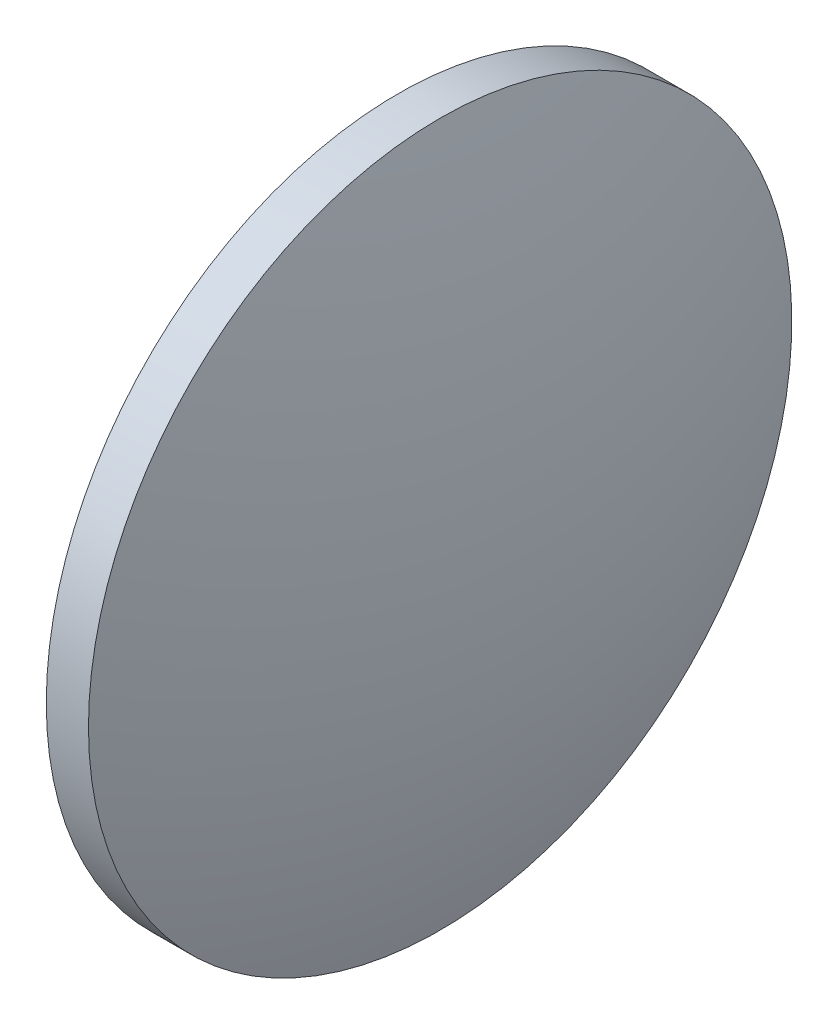
ISO-10303-21;
HEADER;
FILE_DESCRIPTION(('STEP AP214'),'2;1');
FILE_NAME('part.step','',(''),(''),'','','');
FILE_SCHEMA(('AUTOMOTIVE_DESIGN { 1 0 10303 214 1 1 1 1 }'));
ENDSEC;
DATA;
#1=APPLICATION_CONTEXT('core data for automotive mechanical design processes');
#2=APPLICATION_PROTOCOL_DEFINITION('international standard','automotive_design',2000,#1);
#3=PRODUCT_CONTEXT('',#1,'mechanical');
#4=PRODUCT('Part','Part','',(#3));
#5=PRODUCT_RELATED_PRODUCT_CATEGORY('part','',(#4));
#6=PRODUCT_DEFINITION_FORMATION('','',#4);
#7=PRODUCT_DEFINITION_CONTEXT('part definition',#1,'design');
#8=PRODUCT_DEFINITION('design','',#6,#7);
#9=PRODUCT_DEFINITION_SHAPE('','',#8);
#10=(LENGTH_UNIT() NAMED_UNIT(*) SI_UNIT(.MILLI.,.METRE.));
#11=(NAMED_UNIT(*) PLANE_ANGLE_UNIT() SI_UNIT($,.RADIAN.));
#12=(NAMED_UNIT(*) SI_UNIT($,.STERADIAN.) SOLID_ANGLE_UNIT());
#13=UNCERTAINTY_MEASURE_WITH_UNIT(LENGTH_MEASURE(1.E-05),#10,'distance_accuracy_value','');
#14=(GEOMETRIC_REPRESENTATION_CONTEXT(3) GLOBAL_UNCERTAINTY_ASSIGNED_CONTEXT((#13)) GLOBAL_UNIT_ASSIGNED_CONTEXT((#10,
#11,#12)) REPRESENTATION_CONTEXT('',''));
#15=CARTESIAN_POINT('',(0.,0.,0.));
#16=DIRECTION('',(0.,0.,1.));
#17=DIRECTION('',(1.,0.,0.));
#18=AXIS2_PLACEMENT_3D('',#15,#16,#17);
#19=CARTESIAN_POINT('',(339.997021183809,102.301186730965,0.));
#20=DIRECTION('',(-1.,0.,0.));
#21=DIRECTION('',(0.,1.,0.));
#22=AXIS2_PLACEMENT_3D('',#19,#20,#21);
#23=SPHERICAL_SURFACE('',#22,82.6843540051678);
#24=CARTESIAN_POINT('',(418.811375188977,102.301186730965,0.));
#25=DIRECTION('',(-1.,0.,0.));
#26=DIRECTION('',(0.,0.,1.));
#27=AXIS2_PLACEMENT_3D('',#24,#25,#26);
#28=CIRCLE('',#27,25.);
#29=CARTESIAN_POINT('',(418.811375188977,102.301186730965,25.));
#30=VERTEX_POINT('',#29);
#31=EDGE_CURVE('E10',#30,#30,#28,.T.);
#32=ORIENTED_EDGE('',*,*,#31,.F.);
#33=EDGE_LOOP('',(#32));
#34=FACE_BOUND('',#33,.T.);
#35=ADVANCED_FACE('F35',(#34),#23,.T.);
#36=CARTESIAN_POINT('',(406.389135751789,102.301186730965,0.));
#37=DIRECTION('',(-1.,0.,0.));
#38=DIRECTION('',(0.,0.,1.));
#39=AXIS2_PLACEMENT_3D('',#36,#37,#38);
#40=CYLINDRICAL_SURFACE('',#39,25.);
#41=CARTESIAN_POINT('',(415.811375188977,102.301186730965,0.));
#42=DIRECTION('',(-1.,0.,0.));
#43=DIRECTION('',(0.,0.,1.));
#44=AXIS2_PLACEMENT_3D('',#41,#42,#43);
#45=CIRCLE('',#44,25.);
#46=CARTESIAN_POINT('',(415.811375188977,102.301186730965,25.));
#47=VERTEX_POINT('',#46);
#48=EDGE_CURVE('E41',#47,#47,#45,.T.);
#49=ORIENTED_EDGE('',*,*,#48,.F.);
#50=EDGE_LOOP('',(#49));
#51=FACE_BOUND('',#50,.T.);
#52=ORIENTED_EDGE('',*,*,#31,.T.);
#53=EDGE_LOOP('',(#52));
#54=FACE_BOUND('',#53,.T.);
#55=ADVANCED_FACE('F49',(#51,#54),#40,.T.);
#56=CARTESIAN_POINT('',(415.811375188977,102.301186730965,0.));
#57=DIRECTION('',(1.,0.,0.));
#58=DIRECTION('',(0.,0.,-1.));
#59=AXIS2_PLACEMENT_3D('',#56,#57,#58);
#60=PLANE('',#59);
#61=ORIENTED_EDGE('',*,*,#48,.T.);
#62=EDGE_LOOP('',(#61));
#63=FACE_BOUND('',#62,.T.);
#64=ADVANCED_FACE('F47',(#63),#60,.F.);
#65=CLOSED_SHELL('',(#35,#55,#64));
#66=MANIFOLD_SOLID_BREP('B2',#65);
#67=ADVANCED_BREP_SHAPE_REPRESENTATION('',(#18,#66),#14);
#68=SHAPE_DEFINITION_REPRESENTATION(#9,#67);
ENDSEC;
END-ISO-10303-21;
